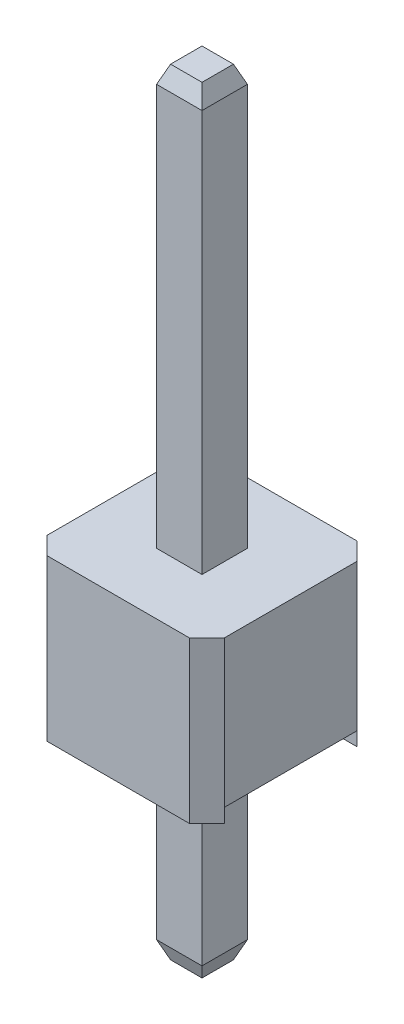
ISO-10303-21;
HEADER;
FILE_DESCRIPTION(('STEP AP214'),'2;1');
FILE_NAME('part.step','',(''),(''),'','','');
FILE_SCHEMA(('AUTOMOTIVE_DESIGN { 1 0 10303 214 1 1 1 1 }'));
ENDSEC;
DATA;
#1=APPLICATION_CONTEXT('core data for automotive mechanical design processes');
#2=APPLICATION_PROTOCOL_DEFINITION('international standard','automotive_design',2000,#1);
#3=PRODUCT_CONTEXT('',#1,'mechanical');
#4=PRODUCT('Part','Part','',(#3));
#5=PRODUCT_RELATED_PRODUCT_CATEGORY('part','',(#4));
#6=PRODUCT_DEFINITION_FORMATION('','',#4);
#7=PRODUCT_DEFINITION_CONTEXT('part definition',#1,'design');
#8=PRODUCT_DEFINITION('design','',#6,#7);
#9=PRODUCT_DEFINITION_SHAPE('','',#8);
#10=(LENGTH_UNIT() NAMED_UNIT(*) SI_UNIT(.MILLI.,.METRE.));
#11=(NAMED_UNIT(*) PLANE_ANGLE_UNIT() SI_UNIT($,.RADIAN.));
#12=(NAMED_UNIT(*) SI_UNIT($,.STERADIAN.) SOLID_ANGLE_UNIT());
#13=UNCERTAINTY_MEASURE_WITH_UNIT(LENGTH_MEASURE(1.E-05),#10,'distance_accuracy_value','');
#14=(GEOMETRIC_REPRESENTATION_CONTEXT(3) GLOBAL_UNCERTAINTY_ASSIGNED_CONTEXT((#13)) GLOBAL_UNIT_ASSIGNED_CONTEXT((#10,
#11,#12)) REPRESENTATION_CONTEXT('',''));
#15=CARTESIAN_POINT('',(0.,0.,0.));
#16=DIRECTION('',(0.,0.,1.));
#17=DIRECTION('',(1.,0.,0.));
#18=AXIS2_PLACEMENT_3D('',#15,#16,#17);
#19=CARTESIAN_POINT('',(0.,0.2,0.55));
#20=DIRECTION('',(0.,0.371390676354102,-0.92847669088526));
#21=DIRECTION('',(-1.,0.,0.));
#22=AXIS2_PLACEMENT_3D('',#19,#20,#21);
#23=PLANE('',#22);
#24=DIRECTION('',(0.348155311911395,0.87038827977849,0.348155311911395));
#25=VECTOR('',#24,1.);
#26=CARTESIAN_POINT('',(0.483333333333334,0.0333333333333339,0.483333333333334));
#27=LINE('',#26,#25);
#28=CARTESIAN_POINT('',(0.55,0.2,0.55));
#29=VERTEX_POINT('',#28);
#30=CARTESIAN_POINT('',(0.65,0.45,0.65));
#31=VERTEX_POINT('',#30);
#32=EDGE_CURVE('E27',#29,#31,#27,.T.);
#33=ORIENTED_EDGE('',*,*,#32,.T.);
#34=DIRECTION('',(1.,0.,0.));
#35=VECTOR('',#34,1.);
#36=CARTESIAN_POINT('',(0.,0.45,0.65));
#37=LINE('',#36,#35);
#38=CARTESIAN_POINT('',(0.,0.45,0.65));
#39=VERTEX_POINT('',#38);
#40=EDGE_CURVE('E308',#39,#31,#37,.T.);
#41=ORIENTED_EDGE('',*,*,#40,.F.);
#42=DIRECTION('',(0.348155311911395,-0.87038827977849,-0.348155311911395));
#43=VECTOR('',#42,1.);
#44=CARTESIAN_POINT('',(0.166666666666666,0.0333333333333339,0.483333333333334));
#45=LINE('',#44,#43);
#46=CARTESIAN_POINT('',(0.1,0.2,0.55));
#47=VERTEX_POINT('',#46);
#48=EDGE_CURVE('E10',#39,#47,#45,.T.);
#49=ORIENTED_EDGE('',*,*,#48,.T.);
#50=DIRECTION('',(-1.,0.,0.));
#51=VECTOR('',#50,1.);
#52=CARTESIAN_POINT('',(0.,0.2,0.55));
#53=LINE('',#52,#51);
#54=EDGE_CURVE('E316',#29,#47,#53,.T.);
#55=ORIENTED_EDGE('',*,*,#54,.F.);
#56=EDGE_LOOP('',(#33,#41,#49,#55));
#57=FACE_BOUND('',#56,.T.);
#58=ADVANCED_FACE('F16',(#57),#23,.F.);
#59=CARTESIAN_POINT('',(0.1,0.2,0.));
#60=DIRECTION('',(0.92847669088526,0.371390676354102,0.));
#61=DIRECTION('',(0.,0.,-1.));
#62=AXIS2_PLACEMENT_3D('',#59,#60,#61);
#63=PLANE('',#62);
#64=DIRECTION('',(0.348155311911395,-0.87038827977849,0.348155311911395));
#65=VECTOR('',#64,1.);
#66=CARTESIAN_POINT('',(0.0878787878787882,0.23030303030303,0.0878787878787882));
#67=LINE('',#66,#65);
#68=CARTESIAN_POINT('',(0.,0.45,0.));
#69=VERTEX_POINT('',#68);
#70=CARTESIAN_POINT('',(0.1,0.2,0.1));
#71=VERTEX_POINT('',#70);
#72=EDGE_CURVE('E42',#69,#71,#67,.T.);
#73=ORIENTED_EDGE('',*,*,#72,.T.);
#74=DIRECTION('',(0.,0.,-1.));
#75=VECTOR('',#74,1.);
#76=CARTESIAN_POINT('',(0.1,0.2,0.));
#77=LINE('',#76,#75);
#78=EDGE_CURVE('E320',#47,#71,#77,.T.);
#79=ORIENTED_EDGE('',*,*,#78,.F.);
#80=ORIENTED_EDGE('',*,*,#48,.F.);
#81=DIRECTION('',(0.,0.,1.));
#82=VECTOR('',#81,1.);
#83=CARTESIAN_POINT('',(0.,0.45,0.));
#84=LINE('',#83,#82);
#85=EDGE_CURVE('E272',#69,#39,#84,.T.);
#86=ORIENTED_EDGE('',*,*,#85,.F.);
#87=EDGE_LOOP('',(#73,#79,#80,#86));
#88=FACE_BOUND('',#87,.T.);
#89=ADVANCED_FACE('F550',(#88),#63,.F.);
#90=CARTESIAN_POINT('',(0.55,0.2,0.));
#91=DIRECTION('',(-0.92847669088526,0.371390676354102,0.));
#92=DIRECTION('',(0.,0.,1.));
#93=AXIS2_PLACEMENT_3D('',#90,#91,#92);
#94=PLANE('',#93);
#95=DIRECTION('',(0.348155311911395,0.87038827977849,-0.348155311911395));
#96=VECTOR('',#95,1.);
#97=CARTESIAN_POINT('',(0.483333333333334,0.0333333333333339,0.166666666666666));
#98=LINE('',#97,#96);
#99=CARTESIAN_POINT('',(0.55,0.2,0.1));
#100=VERTEX_POINT('',#99);
#101=CARTESIAN_POINT('',(0.65,0.45,0.));
#102=VERTEX_POINT('',#101);
#103=EDGE_CURVE('E303',#100,#102,#98,.T.);
#104=ORIENTED_EDGE('',*,*,#103,.T.);
#105=DIRECTION('',(0.,0.,-1.));
#106=VECTOR('',#105,1.);
#107=CARTESIAN_POINT('',(0.65,0.45,0.));
#108=LINE('',#107,#106);
#109=EDGE_CURVE('E20',#31,#102,#108,.T.);
#110=ORIENTED_EDGE('',*,*,#109,.F.);
#111=ORIENTED_EDGE('',*,*,#32,.F.);
#112=DIRECTION('',(0.,0.,1.));
#113=VECTOR('',#112,1.);
#114=CARTESIAN_POINT('',(0.55,0.2,0.));
#115=LINE('',#114,#113);
#116=EDGE_CURVE('E312',#100,#29,#115,.T.);
#117=ORIENTED_EDGE('',*,*,#116,.F.);
#118=EDGE_LOOP('',(#104,#110,#111,#117));
#119=FACE_BOUND('',#118,.T.);
#120=ADVANCED_FACE('F556',(#119),#94,.F.);
#121=CARTESIAN_POINT('',(0.,0.2,0.1));
#122=DIRECTION('',(0.,0.371390676354102,0.92847669088526));
#123=DIRECTION('',(1.,0.,0.));
#124=AXIS2_PLACEMENT_3D('',#121,#122,#123);
#125=PLANE('',#124);
#126=ORIENTED_EDGE('',*,*,#72,.F.);
#127=DIRECTION('',(-1.,0.,0.));
#128=VECTOR('',#127,1.);
#129=CARTESIAN_POINT('',(0.,0.45,0.));
#130=LINE('',#129,#128);
#131=EDGE_CURVE('E321',#102,#69,#130,.T.);
#132=ORIENTED_EDGE('',*,*,#131,.F.);
#133=ORIENTED_EDGE('',*,*,#103,.F.);
#134=DIRECTION('',(1.,0.,0.));
#135=VECTOR('',#134,1.);
#136=CARTESIAN_POINT('',(0.,0.2,0.1));
#137=LINE('',#136,#135);
#138=EDGE_CURVE('E348',#71,#100,#137,.T.);
#139=ORIENTED_EDGE('',*,*,#138,.F.);
#140=EDGE_LOOP('',(#126,#132,#133,#139));
#141=FACE_BOUND('',#140,.T.);
#142=ADVANCED_FACE('F593',(#141),#125,.F.);
#143=CARTESIAN_POINT('',(0.,0.2,0.));
#144=DIRECTION('',(0.,1.,0.));
#145=DIRECTION('',(1.,0.,0.));
#146=AXIS2_PLACEMENT_3D('',#143,#144,#145);
#147=PLANE('',#146);
#148=ORIENTED_EDGE('',*,*,#116,.T.);
#149=ORIENTED_EDGE('',*,*,#54,.T.);
#150=ORIENTED_EDGE('',*,*,#78,.T.);
#151=ORIENTED_EDGE('',*,*,#138,.T.);
#152=EDGE_LOOP('',(#148,#149,#150,#151));
#153=FACE_BOUND('',#152,.T.);
#154=ADVANCED_FACE('F584',(#153),#147,.F.);
#155=CARTESIAN_POINT('',(0.,0.2,0.65));
#156=DIRECTION('',(0.,0.,-1.));
#157=DIRECTION('',(0.,-1.,0.));
#158=AXIS2_PLACEMENT_3D('',#155,#156,#157);
#159=PLANE('',#158);
#160=DIRECTION('',(0.,1.,0.));
#161=VECTOR('',#160,1.);
#162=CARTESIAN_POINT('',(0.,0.2,0.65));
#163=LINE('',#162,#161);
#164=CARTESIAN_POINT('',(0.,3.2,0.65));
#165=VERTEX_POINT('',#164);
#166=EDGE_CURVE('E268',#39,#165,#163,.T.);
#167=ORIENTED_EDGE('',*,*,#166,.F.);
#168=ORIENTED_EDGE('',*,*,#40,.T.);
#169=DIRECTION('',(0.,1.,0.));
#170=VECTOR('',#169,1.);
#171=CARTESIAN_POINT('',(0.65,0.2,0.65));
#172=LINE('',#171,#170);
#173=CARTESIAN_POINT('',(0.65,3.2,0.65));
#174=VERTEX_POINT('',#173);
#175=EDGE_CURVE('E324',#31,#174,#172,.T.);
#176=ORIENTED_EDGE('',*,*,#175,.T.);
#177=DIRECTION('',(-1.,0.,0.));
#178=VECTOR('',#177,1.);
#179=CARTESIAN_POINT('',(0.,3.2,0.65));
#180=LINE('',#179,#178);
#181=EDGE_CURVE('E260',#174,#165,#180,.T.);
#182=ORIENTED_EDGE('',*,*,#181,.T.);
#183=EDGE_LOOP('',(#167,#168,#176,#182));
#184=FACE_BOUND('',#183,.T.);
#185=ADVANCED_FACE('F581',(#184),#159,.F.);
#186=CARTESIAN_POINT('',(0.65,0.2,0.));
#187=DIRECTION('',(-1.,0.,0.));
#188=DIRECTION('',(0.,0.,1.));
#189=AXIS2_PLACEMENT_3D('',#186,#187,#188);
#190=PLANE('',#189);
#191=ORIENTED_EDGE('',*,*,#175,.F.);
#192=ORIENTED_EDGE('',*,*,#109,.T.);
#193=DIRECTION('',(0.,1.,0.));
#194=VECTOR('',#193,1.);
#195=CARTESIAN_POINT('',(0.65,0.2,0.));
#196=LINE('',#195,#194);
#197=CARTESIAN_POINT('',(0.65,3.2,0.));
#198=VERTEX_POINT('',#197);
#199=EDGE_CURVE('E271',#102,#198,#196,.T.);
#200=ORIENTED_EDGE('',*,*,#199,.T.);
#201=DIRECTION('',(0.,0.,1.));
#202=VECTOR('',#201,1.);
#203=CARTESIAN_POINT('',(0.65,3.2,0.));
#204=LINE('',#203,#202);
#205=EDGE_CURVE('E387',#198,#174,#204,.T.);
#206=ORIENTED_EDGE('',*,*,#205,.T.);
#207=EDGE_LOOP('',(#191,#192,#200,#206));
#208=FACE_BOUND('',#207,.T.);
#209=ADVANCED_FACE('F583',(#208),#190,.F.);
#210=CARTESIAN_POINT('',(0.,0.2,0.));
#211=DIRECTION('',(0.,0.,1.));
#212=DIRECTION('',(1.,0.,0.));
#213=AXIS2_PLACEMENT_3D('',#210,#211,#212);
#214=PLANE('',#213);
#215=ORIENTED_EDGE('',*,*,#199,.F.);
#216=ORIENTED_EDGE('',*,*,#131,.T.);
#217=DIRECTION('',(0.,1.,0.));
#218=VECTOR('',#217,1.);
#219=CARTESIAN_POINT('',(0.,0.2,0.));
#220=LINE('',#219,#218);
#221=CARTESIAN_POINT('',(0.,3.2,0.));
#222=VERTEX_POINT('',#221);
#223=EDGE_CURVE('E414',#69,#222,#220,.T.);
#224=ORIENTED_EDGE('',*,*,#223,.T.);
#225=DIRECTION('',(1.,0.,0.));
#226=VECTOR('',#225,1.);
#227=CARTESIAN_POINT('',(0.,3.2,0.));
#228=LINE('',#227,#226);
#229=EDGE_CURVE('E391',#222,#198,#228,.T.);
#230=ORIENTED_EDGE('',*,*,#229,.T.);
#231=EDGE_LOOP('',(#215,#216,#224,#230));
#232=FACE_BOUND('',#231,.T.);
#233=ADVANCED_FACE('F590',(#232),#214,.F.);
#234=CARTESIAN_POINT('',(0.,0.2,0.));
#235=DIRECTION('',(1.,0.,0.));
#236=DIRECTION('',(0.,1.,0.));
#237=AXIS2_PLACEMENT_3D('',#234,#235,#236);
#238=PLANE('',#237);
#239=ORIENTED_EDGE('',*,*,#223,.F.);
#240=ORIENTED_EDGE('',*,*,#85,.T.);
#241=ORIENTED_EDGE('',*,*,#166,.T.);
#242=DIRECTION('',(0.,0.,-1.));
#243=VECTOR('',#242,1.);
#244=CARTESIAN_POINT('',(0.,3.2,0.));
#245=LINE('',#244,#243);
#246=EDGE_CURVE('E353',#165,#222,#245,.T.);
#247=ORIENTED_EDGE('',*,*,#246,.T.);
#248=EDGE_LOOP('',(#239,#240,#241,#247));
#249=FACE_BOUND('',#248,.T.);
#250=ADVANCED_FACE('F559',(#249),#238,.F.);
#251=CARTESIAN_POINT('',(-4.405,3.,1.275));
#252=DIRECTION('',(0.,0.,1.));
#253=DIRECTION('',(1.,0.,0.));
#254=AXIS2_PLACEMENT_3D('',#251,#252,#253);
#255=PLANE('',#254);
#256=DIRECTION('',(0.,1.,0.));
#257=VECTOR('',#256,1.);
#258=CARTESIAN_POINT('',(-0.945,5.3,1.275));
#259=LINE('',#258,#257);
#260=CARTESIAN_POINT('',(-0.945,3.,1.275));
#261=VERTEX_POINT('',#260);
#262=CARTESIAN_POINT('',(-0.945,3.2,1.275));
#263=VERTEX_POINT('',#262);
#264=EDGE_CURVE('E415',#261,#263,#259,.T.);
#265=ORIENTED_EDGE('',*,*,#264,.T.);
#266=DIRECTION('',(1.,0.,0.));
#267=VECTOR('',#266,1.);
#268=CARTESIAN_POINT('',(-4.405,3.2,1.275));
#269=LINE('',#268,#267);
#270=CARTESIAN_POINT('',(1.595,3.2,1.275));
#271=VERTEX_POINT('',#270);
#272=EDGE_CURVE('E349',#263,#271,#269,.T.);
#273=ORIENTED_EDGE('',*,*,#272,.T.);
#274=DIRECTION('',(0.,-1.,0.));
#275=VECTOR('',#274,1.);
#276=CARTESIAN_POINT('',(1.595,3.,1.275));
#277=LINE('',#276,#275);
#278=CARTESIAN_POINT('',(1.595,3.,1.275));
#279=VERTEX_POINT('',#278);
#280=EDGE_CURVE('E418',#271,#279,#277,.T.);
#281=ORIENTED_EDGE('',*,*,#280,.T.);
#282=DIRECTION('',(1.,0.,0.));
#283=VECTOR('',#282,1.);
#284=CARTESIAN_POINT('',(-4.405,3.,1.275));
#285=LINE('',#284,#283);
#286=EDGE_CURVE('E404',#261,#279,#285,.T.);
#287=ORIENTED_EDGE('',*,*,#286,.F.);
#288=EDGE_LOOP('',(#265,#273,#281,#287));
#289=FACE_BOUND('',#288,.T.);
#290=ADVANCED_FACE('F580',(#289),#255,.F.);
#291=CARTESIAN_POINT('',(-4.405,3.,-0.625));
#292=DIRECTION('',(0.,0.,-1.));
#293=DIRECTION('',(0.,-1.,0.));
#294=AXIS2_PLACEMENT_3D('',#291,#292,#293);
#295=PLANE('',#294);
#296=DIRECTION('',(0.,-1.,0.));
#297=VECTOR('',#296,1.);
#298=CARTESIAN_POINT('',(-0.945,5.3,-0.625));
#299=LINE('',#298,#297);
#300=CARTESIAN_POINT('',(-0.945,3.2,-0.625));
#301=VERTEX_POINT('',#300);
#302=CARTESIAN_POINT('',(-0.945,3.,-0.625));
#303=VERTEX_POINT('',#302);
#304=EDGE_CURVE('E419',#301,#303,#299,.T.);
#305=ORIENTED_EDGE('',*,*,#304,.T.);
#306=DIRECTION('',(1.,0.,0.));
#307=VECTOR('',#306,1.);
#308=CARTESIAN_POINT('',(-4.405,3.,-0.625));
#309=LINE('',#308,#307);
#310=CARTESIAN_POINT('',(1.595,3.,-0.625));
#311=VERTEX_POINT('',#310);
#312=EDGE_CURVE('E358',#303,#311,#309,.T.);
#313=ORIENTED_EDGE('',*,*,#312,.T.);
#314=DIRECTION('',(0.,1.,0.));
#315=VECTOR('',#314,1.);
#316=CARTESIAN_POINT('',(1.595,5.3,-0.625));
#317=LINE('',#316,#315);
#318=CARTESIAN_POINT('',(1.595,3.2,-0.625));
#319=VERTEX_POINT('',#318);
#320=EDGE_CURVE('E449',#311,#319,#317,.T.);
#321=ORIENTED_EDGE('',*,*,#320,.T.);
#322=DIRECTION('',(1.,0.,0.));
#323=VECTOR('',#322,1.);
#324=CARTESIAN_POINT('',(-4.405,3.2,-0.625));
#325=LINE('',#324,#323);
#326=EDGE_CURVE('E283',#301,#319,#325,.T.);
#327=ORIENTED_EDGE('',*,*,#326,.F.);
#328=EDGE_LOOP('',(#305,#313,#321,#327));
#329=FACE_BOUND('',#328,.T.);
#330=ADVANCED_FACE('F474',(#329),#295,.F.);
#331=CARTESIAN_POINT('',(1.345,5.3,-0.875));
#332=DIRECTION('',(-0.70710678118655,0.,0.707106781186545));
#333=DIRECTION('',(0.,1.,0.));
#334=AXIS2_PLACEMENT_3D('',#331,#332,#333);
#335=PLANE('',#334);
#336=DIRECTION('',(-0.707106781186545,0.,-0.70710678118655));
#337=VECTOR('',#336,1.);
#338=CARTESIAN_POINT('',(1.345,5.3,-0.875));
#339=LINE('',#338,#337);
#340=CARTESIAN_POINT('',(1.595,5.3,-0.625));
#341=VERTEX_POINT('',#340);
#342=CARTESIAN_POINT('',(1.345,5.3,-0.875));
#343=VERTEX_POINT('',#342);
#344=EDGE_CURVE('E354',#341,#343,#339,.T.);
#345=ORIENTED_EDGE('',*,*,#344,.F.);
#346=DIRECTION('',(0.,1.,0.));
#347=VECTOR('',#346,1.);
#348=CARTESIAN_POINT('',(1.595,5.3,-0.625));
#349=LINE('',#348,#347);
#350=EDGE_CURVE('E368',#319,#341,#349,.T.);
#351=ORIENTED_EDGE('',*,*,#350,.F.);
#352=ORIENTED_EDGE('',*,*,#320,.F.);
#353=DIRECTION('',(0.707106781186545,0.,0.70710678118655));
#354=VECTOR('',#353,1.);
#355=CARTESIAN_POINT('',(1.11,3.,-1.11));
#356=LINE('',#355,#354);
#357=CARTESIAN_POINT('',(1.345,3.,-0.875));
#358=VERTEX_POINT('',#357);
#359=EDGE_CURVE('E364',#358,#311,#356,.T.);
#360=ORIENTED_EDGE('',*,*,#359,.F.);
#361=DIRECTION('',(0.,-1.,0.));
#362=VECTOR('',#361,1.);
#363=CARTESIAN_POINT('',(1.345,5.3,-0.875));
#364=LINE('',#363,#362);
#365=EDGE_CURVE('E277',#343,#358,#364,.T.);
#366=ORIENTED_EDGE('',*,*,#365,.F.);
#367=EDGE_LOOP('',(#345,#351,#352,#360,#366));
#368=FACE_BOUND('',#367,.T.);
#369=ADVANCED_FACE('F484',(#368),#335,.F.);
#370=CARTESIAN_POINT('',(1.595,5.3,1.275));
#371=DIRECTION('',(-0.707106781186545,0.,-0.70710678118655));
#372=DIRECTION('',(-0.70710678118655,0.,0.707106781186545));
#373=AXIS2_PLACEMENT_3D('',#370,#371,#372);
#374=PLANE('',#373);
#375=DIRECTION('',(0.70710678118655,0.,-0.707106781186545));
#376=VECTOR('',#375,1.);
#377=CARTESIAN_POINT('',(1.595,5.3,1.275));
#378=LINE('',#377,#376);
#379=CARTESIAN_POINT('',(1.345,5.3,1.525));
#380=VERTEX_POINT('',#379);
#381=CARTESIAN_POINT('',(1.595,5.3,1.275));
#382=VERTEX_POINT('',#381);
#383=EDGE_CURVE('E266',#380,#382,#378,.T.);
#384=ORIENTED_EDGE('',*,*,#383,.F.);
#385=DIRECTION('',(0.,1.,0.));
#386=VECTOR('',#385,1.);
#387=CARTESIAN_POINT('',(1.345,5.3,1.525));
#388=LINE('',#387,#386);
#389=CARTESIAN_POINT('',(1.345,3.,1.525));
#390=VERTEX_POINT('',#389);
#391=EDGE_CURVE('E298',#390,#380,#388,.T.);
#392=ORIENTED_EDGE('',*,*,#391,.F.);
#393=DIRECTION('',(-0.70710678118655,0.,0.707106781186545));
#394=VECTOR('',#393,1.);
#395=CARTESIAN_POINT('',(1.435,3.,1.435));
#396=LINE('',#395,#394);
#397=EDGE_CURVE('E408',#279,#390,#396,.T.);
#398=ORIENTED_EDGE('',*,*,#397,.F.);
#399=ORIENTED_EDGE('',*,*,#280,.F.);
#400=DIRECTION('',(0.,-1.,0.));
#401=VECTOR('',#400,1.);
#402=CARTESIAN_POINT('',(1.595,5.3,1.275));
#403=LINE('',#402,#401);
#404=EDGE_CURVE('E394',#382,#271,#403,.T.);
#405=ORIENTED_EDGE('',*,*,#404,.F.);
#406=EDGE_LOOP('',(#384,#392,#398,#399,#405));
#407=FACE_BOUND('',#406,.T.);
#408=ADVANCED_FACE('F574',(#407),#374,.F.);
#409=CARTESIAN_POINT('',(-0.695,5.3,1.525));
#410=DIRECTION('',(0.707106781186548,0.,-0.707106781186548));
#411=DIRECTION('',(0.,-1.,0.));
#412=AXIS2_PLACEMENT_3D('',#409,#410,#411);
#413=PLANE('',#412);
#414=DIRECTION('',(0.707106781186548,0.,0.707106781186548));
#415=VECTOR('',#414,1.);
#416=CARTESIAN_POINT('',(-0.695,5.3,1.525));
#417=LINE('',#416,#415);
#418=CARTESIAN_POINT('',(-0.945,5.3,1.275));
#419=VERTEX_POINT('',#418);
#420=CARTESIAN_POINT('',(-0.695,5.3,1.525));
#421=VERTEX_POINT('',#420);
#422=EDGE_CURVE('E267',#419,#421,#417,.T.);
#423=ORIENTED_EDGE('',*,*,#422,.F.);
#424=DIRECTION('',(0.,1.,0.));
#425=VECTOR('',#424,1.);
#426=CARTESIAN_POINT('',(-0.945,5.3,1.275));
#427=LINE('',#426,#425);
#428=EDGE_CURVE('E273',#263,#419,#427,.T.);
#429=ORIENTED_EDGE('',*,*,#428,.F.);
#430=ORIENTED_EDGE('',*,*,#264,.F.);
#431=DIRECTION('',(-0.707106781186548,0.,-0.707106781186548));
#432=VECTOR('',#431,1.);
#433=CARTESIAN_POINT('',(-1.11,3.,1.11));
#434=LINE('',#433,#432);
#435=CARTESIAN_POINT('',(-0.695,3.,1.525));
#436=VERTEX_POINT('',#435);
#437=EDGE_CURVE('E256',#436,#261,#434,.T.);
#438=ORIENTED_EDGE('',*,*,#437,.F.);
#439=DIRECTION('',(0.,-1.,0.));
#440=VECTOR('',#439,1.);
#441=CARTESIAN_POINT('',(-0.695,5.3,1.525));
#442=LINE('',#441,#440);
#443=EDGE_CURVE('E295',#421,#436,#442,.T.);
#444=ORIENTED_EDGE('',*,*,#443,.F.);
#445=EDGE_LOOP('',(#423,#429,#430,#438,#444));
#446=FACE_BOUND('',#445,.T.);
#447=ADVANCED_FACE('F571',(#446),#413,.F.);
#448=CARTESIAN_POINT('',(-0.945,5.3,-0.625));
#449=DIRECTION('',(0.707106781186548,0.,0.707106781186548));
#450=DIRECTION('',(0.,-1.,0.));
#451=AXIS2_PLACEMENT_3D('',#448,#449,#450);
#452=PLANE('',#451);
#453=DIRECTION('',(-0.707106781186548,0.,0.707106781186548));
#454=VECTOR('',#453,1.);
#455=CARTESIAN_POINT('',(-0.945,5.3,-0.625));
#456=LINE('',#455,#454);
#457=CARTESIAN_POINT('',(-0.695,5.3,-0.875));
#458=VERTEX_POINT('',#457);
#459=CARTESIAN_POINT('',(-0.945,5.3,-0.625));
#460=VERTEX_POINT('',#459);
#461=EDGE_CURVE('E282',#458,#460,#456,.T.);
#462=ORIENTED_EDGE('',*,*,#461,.F.);
#463=DIRECTION('',(0.,1.,0.));
#464=VECTOR('',#463,1.);
#465=CARTESIAN_POINT('',(-0.695,5.3,-0.875));
#466=LINE('',#465,#464);
#467=CARTESIAN_POINT('',(-0.695,3.,-0.875));
#468=VERTEX_POINT('',#467);
#469=EDGE_CURVE('E345',#468,#458,#466,.T.);
#470=ORIENTED_EDGE('',*,*,#469,.F.);
#471=DIRECTION('',(0.707106781186548,0.,-0.707106781186548));
#472=VECTOR('',#471,1.);
#473=CARTESIAN_POINT('',(-0.785,3.,-0.785));
#474=LINE('',#473,#472);
#475=EDGE_CURVE('E376',#303,#468,#474,.T.);
#476=ORIENTED_EDGE('',*,*,#475,.F.);
#477=ORIENTED_EDGE('',*,*,#304,.F.);
#478=DIRECTION('',(0.,-1.,0.));
#479=VECTOR('',#478,1.);
#480=CARTESIAN_POINT('',(-0.945,5.3,-0.625));
#481=LINE('',#480,#479);
#482=EDGE_CURVE('E276',#460,#301,#481,.T.);
#483=ORIENTED_EDGE('',*,*,#482,.F.);
#484=EDGE_LOOP('',(#462,#470,#476,#477,#483));
#485=FACE_BOUND('',#484,.T.);
#486=ADVANCED_FACE('F505',(#485),#452,.F.);
#487=CARTESIAN_POINT('',(1.595,5.3,1.525));
#488=DIRECTION('',(0.,0.,1.));
#489=DIRECTION('',(1.,0.,0.));
#490=AXIS2_PLACEMENT_3D('',#487,#488,#489);
#491=PLANE('',#490);
#492=DIRECTION('',(-1.,0.,0.));
#493=VECTOR('',#492,1.);
#494=CARTESIAN_POINT('',(1.595,5.3,1.525));
#495=LINE('',#494,#493);
#496=EDGE_CURVE('E262',#380,#421,#495,.T.);
#497=ORIENTED_EDGE('',*,*,#496,.T.);
#498=ORIENTED_EDGE('',*,*,#443,.T.);
#499=DIRECTION('',(-1.,0.,0.));
#500=VECTOR('',#499,1.);
#501=CARTESIAN_POINT('',(1.595,3.,1.525));
#502=LINE('',#501,#500);
#503=EDGE_CURVE('E442',#390,#436,#502,.T.);
#504=ORIENTED_EDGE('',*,*,#503,.F.);
#505=ORIENTED_EDGE('',*,*,#391,.T.);
#506=EDGE_LOOP('',(#497,#498,#504,#505));
#507=FACE_BOUND('',#506,.T.);
#508=ADVANCED_FACE('F578',(#507),#491,.T.);
#509=CARTESIAN_POINT('',(-0.945,5.3,-0.875));
#510=DIRECTION('',(-1.,0.,0.));
#511=DIRECTION('',(0.,0.,1.));
#512=AXIS2_PLACEMENT_3D('',#509,#510,#511);
#513=PLANE('',#512);
#514=DIRECTION('',(0.,0.,-1.));
#515=VECTOR('',#514,1.);
#516=CARTESIAN_POINT('',(-0.945,3.2,-0.875));
#517=LINE('',#516,#515);
#518=EDGE_CURVE('E288',#263,#301,#517,.T.);
#519=ORIENTED_EDGE('',*,*,#518,.F.);
#520=ORIENTED_EDGE('',*,*,#428,.T.);
#521=DIRECTION('',(0.,0.,-1.));
#522=VECTOR('',#521,1.);
#523=CARTESIAN_POINT('',(-0.945,5.3,-0.875));
#524=LINE('',#523,#522);
#525=EDGE_CURVE('E363',#419,#460,#524,.T.);
#526=ORIENTED_EDGE('',*,*,#525,.T.);
#527=ORIENTED_EDGE('',*,*,#482,.T.);
#528=EDGE_LOOP('',(#519,#520,#526,#527));
#529=FACE_BOUND('',#528,.T.);
#530=ADVANCED_FACE('F498',(#529),#513,.T.);
#531=CARTESIAN_POINT('',(1.595,5.3,-0.875));
#532=DIRECTION('',(0.,0.,-1.));
#533=DIRECTION('',(0.,-1.,0.));
#534=AXIS2_PLACEMENT_3D('',#531,#532,#533);
#535=PLANE('',#534);
#536=DIRECTION('',(1.,0.,0.));
#537=VECTOR('',#536,1.);
#538=CARTESIAN_POINT('',(1.595,3.,-0.875));
#539=LINE('',#538,#537);
#540=EDGE_CURVE('E369',#468,#358,#539,.T.);
#541=ORIENTED_EDGE('',*,*,#540,.F.);
#542=ORIENTED_EDGE('',*,*,#469,.T.);
#543=DIRECTION('',(1.,0.,0.));
#544=VECTOR('',#543,1.);
#545=CARTESIAN_POINT('',(1.595,5.3,-0.875));
#546=LINE('',#545,#544);
#547=EDGE_CURVE('E278',#458,#343,#546,.T.);
#548=ORIENTED_EDGE('',*,*,#547,.T.);
#549=ORIENTED_EDGE('',*,*,#365,.T.);
#550=EDGE_LOOP('',(#541,#542,#548,#549));
#551=FACE_BOUND('',#550,.T.);
#552=ADVANCED_FACE('F508',(#551),#535,.T.);
#553=CARTESIAN_POINT('',(1.595,5.3,-0.875));
#554=DIRECTION('',(1.,0.,0.));
#555=DIRECTION('',(0.,1.,0.));
#556=AXIS2_PLACEMENT_3D('',#553,#554,#555);
#557=PLANE('',#556);
#558=DIRECTION('',(0.,0.,1.));
#559=VECTOR('',#558,1.);
#560=CARTESIAN_POINT('',(1.595,3.2,1.275));
#561=LINE('',#560,#559);
#562=EDGE_CURVE('E287',#319,#271,#561,.T.);
#563=ORIENTED_EDGE('',*,*,#562,.F.);
#564=ORIENTED_EDGE('',*,*,#350,.T.);
#565=DIRECTION('',(0.,0.,1.));
#566=VECTOR('',#565,1.);
#567=CARTESIAN_POINT('',(1.595,5.3,-0.875));
#568=LINE('',#567,#566);
#569=EDGE_CURVE('E359',#341,#382,#568,.T.);
#570=ORIENTED_EDGE('',*,*,#569,.T.);
#571=ORIENTED_EDGE('',*,*,#404,.T.);
#572=EDGE_LOOP('',(#563,#564,#570,#571));
#573=FACE_BOUND('',#572,.T.);
#574=ADVANCED_FACE('F490',(#573),#557,.T.);
#575=CARTESIAN_POINT('',(0.,3.,0.));
#576=DIRECTION('',(0.,-1.,0.));
#577=DIRECTION('',(0.,0.,-1.));
#578=AXIS2_PLACEMENT_3D('',#575,#576,#577);
#579=PLANE('',#578);
#580=ORIENTED_EDGE('',*,*,#312,.F.);
#581=ORIENTED_EDGE('',*,*,#475,.T.);
#582=ORIENTED_EDGE('',*,*,#540,.T.);
#583=ORIENTED_EDGE('',*,*,#359,.T.);
#584=EDGE_LOOP('',(#580,#581,#582,#583));
#585=FACE_BOUND('',#584,.T.);
#586=ADVANCED_FACE('F479',(#585),#579,.T.);
#587=CARTESIAN_POINT('',(0.,5.3,0.));
#588=DIRECTION('',(0.,-1.,0.));
#589=DIRECTION('',(0.,0.,-1.));
#590=AXIS2_PLACEMENT_3D('',#587,#588,#589);
#591=PLANE('',#590);
#592=DIRECTION('',(-1.,0.,0.));
#593=VECTOR('',#592,1.);
#594=CARTESIAN_POINT('',(0.,5.3,0.65));
#595=LINE('',#594,#593);
#596=CARTESIAN_POINT('',(0.65,5.3,0.65));
#597=VERTEX_POINT('',#596);
#598=CARTESIAN_POINT('',(0.,5.3,0.65));
#599=VERTEX_POINT('',#598);
#600=EDGE_CURVE('E326',#597,#599,#595,.T.);
#601=ORIENTED_EDGE('',*,*,#600,.T.);
#602=DIRECTION('',(0.,0.,-1.));
#603=VECTOR('',#602,1.);
#604=CARTESIAN_POINT('',(0.,5.3,0.));
#605=LINE('',#604,#603);
#606=CARTESIAN_POINT('',(0.,5.3,0.));
#607=VERTEX_POINT('',#606);
#608=EDGE_CURVE('E249',#599,#607,#605,.T.);
#609=ORIENTED_EDGE('',*,*,#608,.T.);
#610=DIRECTION('',(1.,0.,0.));
#611=VECTOR('',#610,1.);
#612=CARTESIAN_POINT('',(0.,5.3,0.));
#613=LINE('',#612,#611);
#614=CARTESIAN_POINT('',(0.65,5.3,0.));
#615=VERTEX_POINT('',#614);
#616=EDGE_CURVE('E340',#607,#615,#613,.T.);
#617=ORIENTED_EDGE('',*,*,#616,.T.);
#618=DIRECTION('',(0.,0.,1.));
#619=VECTOR('',#618,1.);
#620=CARTESIAN_POINT('',(0.65,5.3,0.));
#621=LINE('',#620,#619);
#622=EDGE_CURVE('E235',#615,#597,#621,.T.);
#623=ORIENTED_EDGE('',*,*,#622,.T.);
#624=EDGE_LOOP('',(#601,#609,#617,#623));
#625=FACE_BOUND('',#624,.T.);
#626=ORIENTED_EDGE('',*,*,#547,.F.);
#627=ORIENTED_EDGE('',*,*,#461,.T.);
#628=ORIENTED_EDGE('',*,*,#525,.F.);
#629=ORIENTED_EDGE('',*,*,#422,.T.);
#630=ORIENTED_EDGE('',*,*,#496,.F.);
#631=ORIENTED_EDGE('',*,*,#383,.T.);
#632=ORIENTED_EDGE('',*,*,#569,.F.);
#633=ORIENTED_EDGE('',*,*,#344,.T.);
#634=EDGE_LOOP('',(#626,#627,#628,#629,#630,#631,#632,#633));
#635=FACE_BOUND('',#634,.T.);
#636=ADVANCED_FACE('F510',(#625,#635),#591,.F.);
#637=CARTESIAN_POINT('',(0.,11.3,0.1));
#638=DIRECTION('',(0.,0.371390676354102,-0.92847669088526));
#639=DIRECTION('',(-1.,0.,0.));
#640=AXIS2_PLACEMENT_3D('',#637,#638,#639);
#641=PLANE('',#640);
#642=DIRECTION('',(0.348155311911395,-0.87038827977849,-0.348155311911395));
#643=VECTOR('',#642,1.);
#644=CARTESIAN_POINT('',(0.562121212121212,11.269696969697,0.0878787878787882));
#645=LINE('',#644,#643);
#646=CARTESIAN_POINT('',(0.55,11.3,0.1));
#647=VERTEX_POINT('',#646);
#648=CARTESIAN_POINT('',(0.65,11.05,0.));
#649=VERTEX_POINT('',#648);
#650=EDGE_CURVE('E299',#647,#649,#645,.T.);
#651=ORIENTED_EDGE('',*,*,#650,.T.);
#652=DIRECTION('',(1.,0.,0.));
#653=VECTOR('',#652,1.);
#654=CARTESIAN_POINT('',(0.65,11.05,0.));
#655=LINE('',#654,#653);
#656=CARTESIAN_POINT('',(0.,11.05,0.));
#657=VERTEX_POINT('',#656);
#658=EDGE_CURVE('E294',#657,#649,#655,.T.);
#659=ORIENTED_EDGE('',*,*,#658,.F.);
#660=DIRECTION('',(0.348155311911395,0.87038827977849,0.348155311911395));
#661=VECTOR('',#660,1.);
#662=CARTESIAN_POINT('',(0.0878787878787882,11.269696969697,0.0878787878787882));
#663=LINE('',#662,#661);
#664=CARTESIAN_POINT('',(0.1,11.3,0.1));
#665=VERTEX_POINT('',#664);
#666=EDGE_CURVE('E240',#657,#665,#663,.T.);
#667=ORIENTED_EDGE('',*,*,#666,.T.);
#668=DIRECTION('',(-1.,0.,0.));
#669=VECTOR('',#668,1.);
#670=CARTESIAN_POINT('',(0.,11.3,0.1));
#671=LINE('',#670,#669);
#672=EDGE_CURVE('E293',#647,#665,#671,.T.);
#673=ORIENTED_EDGE('',*,*,#672,.F.);
#674=EDGE_LOOP('',(#651,#659,#667,#673));
#675=FACE_BOUND('',#674,.T.);
#676=ADVANCED_FACE('F537',(#675),#641,.T.);
#677=CARTESIAN_POINT('',(0.1,11.3,0.));
#678=DIRECTION('',(-0.92847669088526,0.371390676354102,0.));
#679=DIRECTION('',(0.,0.,1.));
#680=AXIS2_PLACEMENT_3D('',#677,#678,#679);
#681=PLANE('',#680);
#682=DIRECTION('',(0.348155311911395,0.87038827977849,-0.348155311911395));
#683=VECTOR('',#682,1.);
#684=CARTESIAN_POINT('',(0.166666666666666,11.4666666666667,0.483333333333334));
#685=LINE('',#684,#683);
#686=CARTESIAN_POINT('',(0.,11.05,0.65));
#687=VERTEX_POINT('',#686);
#688=CARTESIAN_POINT('',(0.1,11.3,0.55));
#689=VERTEX_POINT('',#688);
#690=EDGE_CURVE('E211',#687,#689,#685,.T.);
#691=ORIENTED_EDGE('',*,*,#690,.T.);
#692=DIRECTION('',(0.,0.,1.));
#693=VECTOR('',#692,1.);
#694=CARTESIAN_POINT('',(0.1,11.3,0.65));
#695=LINE('',#694,#693);
#696=EDGE_CURVE('E307',#665,#689,#695,.T.);
#697=ORIENTED_EDGE('',*,*,#696,.F.);
#698=ORIENTED_EDGE('',*,*,#666,.F.);
#699=DIRECTION('',(0.,0.,-1.));
#700=VECTOR('',#699,1.);
#701=CARTESIAN_POINT('',(0.,11.05,0.));
#702=LINE('',#701,#700);
#703=EDGE_CURVE('E238',#687,#657,#702,.T.);
#704=ORIENTED_EDGE('',*,*,#703,.F.);
#705=EDGE_LOOP('',(#691,#697,#698,#704));
#706=FACE_BOUND('',#705,.T.);
#707=ADVANCED_FACE('F239',(#706),#681,.T.);
#708=CARTESIAN_POINT('',(0.55,11.3,0.));
#709=DIRECTION('',(0.92847669088526,0.371390676354102,0.));
#710=DIRECTION('',(0.,0.,-1.));
#711=AXIS2_PLACEMENT_3D('',#708,#709,#710);
#712=PLANE('',#711);
#713=DIRECTION('',(0.348155311911395,-0.87038827977849,0.348155311911395));
#714=VECTOR('',#713,1.);
#715=CARTESIAN_POINT('',(0.483333333333334,11.4666666666667,0.483333333333334));
#716=LINE('',#715,#714);
#717=CARTESIAN_POINT('',(0.55,11.3,0.55));
#718=VERTEX_POINT('',#717);
#719=CARTESIAN_POINT('',(0.65,11.05,0.65));
#720=VERTEX_POINT('',#719);
#721=EDGE_CURVE('E223',#718,#720,#716,.T.);
#722=ORIENTED_EDGE('',*,*,#721,.T.);
#723=DIRECTION('',(0.,0.,1.));
#724=VECTOR('',#723,1.);
#725=CARTESIAN_POINT('',(0.65,11.05,0.65));
#726=LINE('',#725,#724);
#727=EDGE_CURVE('E386',#649,#720,#726,.T.);
#728=ORIENTED_EDGE('',*,*,#727,.F.);
#729=ORIENTED_EDGE('',*,*,#650,.F.);
#730=DIRECTION('',(0.,0.,-1.));
#731=VECTOR('',#730,1.);
#732=CARTESIAN_POINT('',(0.55,11.3,0.));
#733=LINE('',#732,#731);
#734=EDGE_CURVE('E289',#718,#647,#733,.T.);
#735=ORIENTED_EDGE('',*,*,#734,.F.);
#736=EDGE_LOOP('',(#722,#728,#729,#735));
#737=FACE_BOUND('',#736,.T.);
#738=ADVANCED_FACE('F18',(#737),#712,.T.);
#739=CARTESIAN_POINT('',(0.,11.3,0.55));
#740=DIRECTION('',(0.,0.371390676354102,0.92847669088526));
#741=DIRECTION('',(1.,0.,0.));
#742=AXIS2_PLACEMENT_3D('',#739,#740,#741);
#743=PLANE('',#742);
#744=ORIENTED_EDGE('',*,*,#690,.F.);
#745=DIRECTION('',(-1.,0.,0.));
#746=VECTOR('',#745,1.);
#747=CARTESIAN_POINT('',(0.,11.05,0.65));
#748=LINE('',#747,#746);
#749=EDGE_CURVE('E214',#720,#687,#748,.T.);
#750=ORIENTED_EDGE('',*,*,#749,.F.);
#751=ORIENTED_EDGE('',*,*,#721,.F.);
#752=DIRECTION('',(1.,0.,0.));
#753=VECTOR('',#752,1.);
#754=CARTESIAN_POINT('',(0.65,11.3,0.55));
#755=LINE('',#754,#753);
#756=EDGE_CURVE('E217',#689,#718,#755,.T.);
#757=ORIENTED_EDGE('',*,*,#756,.F.);
#758=EDGE_LOOP('',(#744,#750,#751,#757));
#759=FACE_BOUND('',#758,.T.);
#760=ADVANCED_FACE('F213',(#759),#743,.T.);
#761=CARTESIAN_POINT('',(0.,11.3,0.));
#762=DIRECTION('',(0.,1.,0.));
#763=DIRECTION('',(1.,0.,0.));
#764=AXIS2_PLACEMENT_3D('',#761,#762,#763);
#765=PLANE('',#764);
#766=ORIENTED_EDGE('',*,*,#734,.T.);
#767=ORIENTED_EDGE('',*,*,#672,.T.);
#768=ORIENTED_EDGE('',*,*,#696,.T.);
#769=ORIENTED_EDGE('',*,*,#756,.T.);
#770=EDGE_LOOP('',(#766,#767,#768,#769));
#771=FACE_BOUND('',#770,.T.);
#772=ADVANCED_FACE('F536',(#771),#765,.T.);
#773=CARTESIAN_POINT('',(0.,11.3,0.));
#774=DIRECTION('',(0.,0.,1.));
#775=DIRECTION('',(1.,0.,0.));
#776=AXIS2_PLACEMENT_3D('',#773,#774,#775);
#777=PLANE('',#776);
#778=ORIENTED_EDGE('',*,*,#616,.F.);
#779=DIRECTION('',(0.,-1.,0.));
#780=VECTOR('',#779,1.);
#781=CARTESIAN_POINT('',(0.,11.3,0.));
#782=LINE('',#781,#780);
#783=EDGE_CURVE('E245',#657,#607,#782,.T.);
#784=ORIENTED_EDGE('',*,*,#783,.F.);
#785=ORIENTED_EDGE('',*,*,#658,.T.);
#786=DIRECTION('',(0.,-1.,0.));
#787=VECTOR('',#786,1.);
#788=CARTESIAN_POINT('',(0.65,11.3,0.));
#789=LINE('',#788,#787);
#790=EDGE_CURVE('E382',#649,#615,#789,.T.);
#791=ORIENTED_EDGE('',*,*,#790,.T.);
#792=EDGE_LOOP('',(#778,#784,#785,#791));
#793=FACE_BOUND('',#792,.T.);
#794=ADVANCED_FACE('F529',(#793),#777,.F.);
#795=CARTESIAN_POINT('',(0.65,11.3,0.));
#796=DIRECTION('',(-1.,0.,0.));
#797=DIRECTION('',(0.,1.,0.));
#798=AXIS2_PLACEMENT_3D('',#795,#796,#797);
#799=PLANE('',#798);
#800=ORIENTED_EDGE('',*,*,#622,.F.);
#801=ORIENTED_EDGE('',*,*,#790,.F.);
#802=ORIENTED_EDGE('',*,*,#727,.T.);
#803=DIRECTION('',(0.,-1.,0.));
#804=VECTOR('',#803,1.);
#805=CARTESIAN_POINT('',(0.65,11.3,0.65));
#806=LINE('',#805,#804);
#807=EDGE_CURVE('E233',#720,#597,#806,.T.);
#808=ORIENTED_EDGE('',*,*,#807,.T.);
#809=EDGE_LOOP('',(#800,#801,#802,#808));
#810=FACE_BOUND('',#809,.T.);
#811=ADVANCED_FACE('F526',(#810),#799,.F.);
#812=CARTESIAN_POINT('',(0.,11.3,0.65));
#813=DIRECTION('',(0.,0.,-1.));
#814=DIRECTION('',(0.,-1.,0.));
#815=AXIS2_PLACEMENT_3D('',#812,#813,#814);
#816=PLANE('',#815);
#817=ORIENTED_EDGE('',*,*,#600,.F.);
#818=ORIENTED_EDGE('',*,*,#807,.F.);
#819=ORIENTED_EDGE('',*,*,#749,.T.);
#820=DIRECTION('',(0.,-1.,0.));
#821=VECTOR('',#820,1.);
#822=CARTESIAN_POINT('',(0.,11.3,0.65));
#823=LINE('',#822,#821);
#824=EDGE_CURVE('E230',#687,#599,#823,.T.);
#825=ORIENTED_EDGE('',*,*,#824,.T.);
#826=EDGE_LOOP('',(#817,#818,#819,#825));
#827=FACE_BOUND('',#826,.T.);
#828=ADVANCED_FACE('F228',(#827),#816,.F.);
#829=CARTESIAN_POINT('',(0.,11.3,0.));
#830=DIRECTION('',(1.,0.,0.));
#831=DIRECTION('',(0.,1.,0.));
#832=AXIS2_PLACEMENT_3D('',#829,#830,#831);
#833=PLANE('',#832);
#834=ORIENTED_EDGE('',*,*,#608,.F.);
#835=ORIENTED_EDGE('',*,*,#824,.F.);
#836=ORIENTED_EDGE('',*,*,#703,.T.);
#837=ORIENTED_EDGE('',*,*,#783,.T.);
#838=EDGE_LOOP('',(#834,#835,#836,#837));
#839=FACE_BOUND('',#838,.T.);
#840=ADVANCED_FACE('F247',(#839),#833,.F.);
#841=CARTESIAN_POINT('',(0.,3.,0.));
#842=DIRECTION('',(0.,-1.,0.));
#843=DIRECTION('',(0.,0.,-1.));
#844=AXIS2_PLACEMENT_3D('',#841,#842,#843);
#845=PLANE('',#844);
#846=ORIENTED_EDGE('',*,*,#286,.T.);
#847=ORIENTED_EDGE('',*,*,#397,.T.);
#848=ORIENTED_EDGE('',*,*,#503,.T.);
#849=ORIENTED_EDGE('',*,*,#437,.T.);
#850=EDGE_LOOP('',(#846,#847,#848,#849));
#851=FACE_BOUND('',#850,.T.);
#852=ADVANCED_FACE('F855',(#851),#845,.T.);
#853=CARTESIAN_POINT('',(-4.405,3.2,1.275));
#854=DIRECTION('',(0.,1.,0.));
#855=DIRECTION('',(1.,0.,0.));
#856=AXIS2_PLACEMENT_3D('',#853,#854,#855);
#857=PLANE('',#856);
#858=ORIENTED_EDGE('',*,*,#246,.F.);
#859=ORIENTED_EDGE('',*,*,#181,.F.);
#860=ORIENTED_EDGE('',*,*,#205,.F.);
#861=ORIENTED_EDGE('',*,*,#229,.F.);
#862=EDGE_LOOP('',(#858,#859,#860,#861));
#863=FACE_BOUND('',#862,.T.);
#864=ORIENTED_EDGE('',*,*,#518,.T.);
#865=ORIENTED_EDGE('',*,*,#326,.T.);
#866=ORIENTED_EDGE('',*,*,#562,.T.);
#867=ORIENTED_EDGE('',*,*,#272,.F.);
#868=EDGE_LOOP('',(#864,#865,#866,#867));
#869=FACE_BOUND('',#868,.T.);
#870=ADVANCED_FACE('F495',(#863,#869),#857,.F.);
#871=CLOSED_SHELL('',(#58,#89,#120,#142,#154,#185,#209,#233,#250,#290,#330,#369,#408,#447,#486,
#508,#530,#552,#574,#586,#636,#676,#707,#738,#760,#772,#794,#811,#828,#840,#852,#870));
#872=MANIFOLD_SOLID_BREP('B1',#871);
#873=ADVANCED_BREP_SHAPE_REPRESENTATION('',(#18,#872),#14);
#874=SHAPE_DEFINITION_REPRESENTATION(#9,#873);
ENDSEC;
END-ISO-10303-21;
